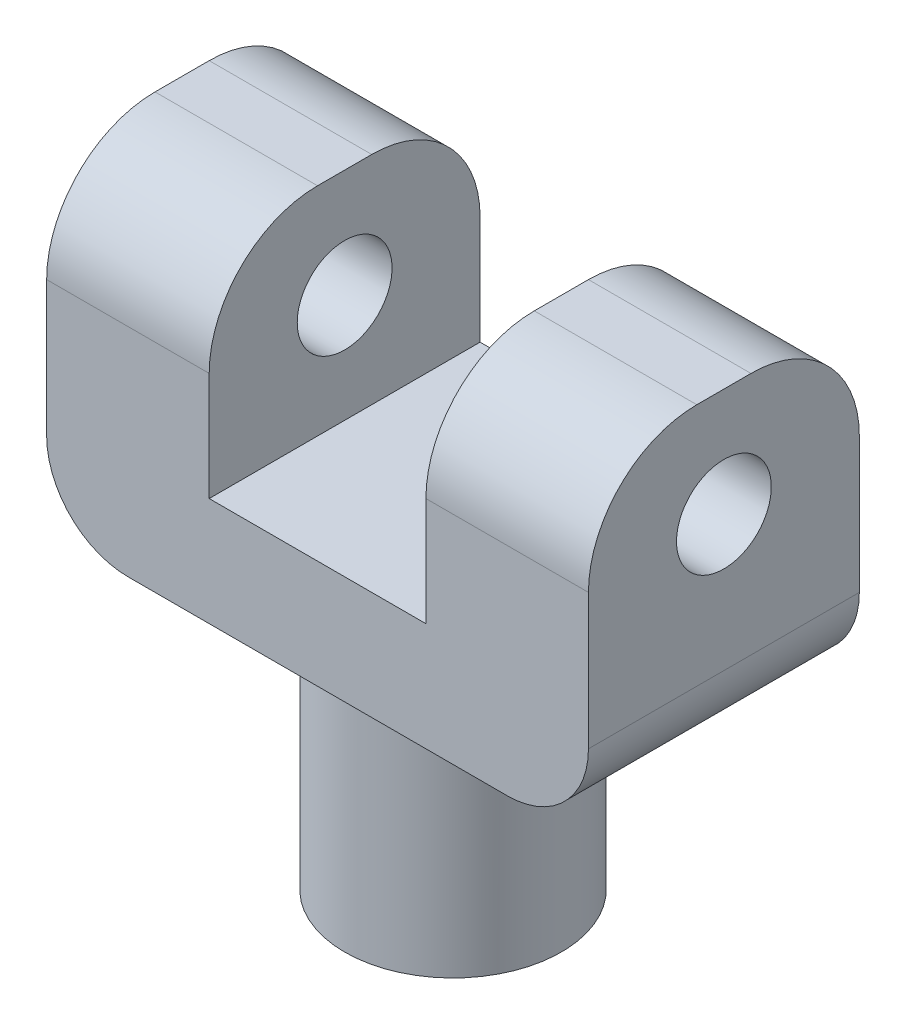
ISO-10303-21;
HEADER;
FILE_DESCRIPTION(('STEP AP214'),'2;1');
FILE_NAME('part.step','',(''),(''),'','','');
FILE_SCHEMA(('AUTOMOTIVE_DESIGN { 1 0 10303 214 1 1 1 1 }'));
ENDSEC;
DATA;
#1=APPLICATION_CONTEXT('core data for automotive mechanical design processes');
#2=APPLICATION_PROTOCOL_DEFINITION('international standard','automotive_design',2000,#1);
#3=PRODUCT_CONTEXT('',#1,'mechanical');
#4=PRODUCT('Part','Part','',(#3));
#5=PRODUCT_RELATED_PRODUCT_CATEGORY('part','',(#4));
#6=PRODUCT_DEFINITION_FORMATION('','',#4);
#7=PRODUCT_DEFINITION_CONTEXT('part definition',#1,'design');
#8=PRODUCT_DEFINITION('design','',#6,#7);
#9=PRODUCT_DEFINITION_SHAPE('','',#8);
#10=(LENGTH_UNIT() NAMED_UNIT(*) SI_UNIT(.MILLI.,.METRE.));
#11=(NAMED_UNIT(*) PLANE_ANGLE_UNIT() SI_UNIT($,.RADIAN.));
#12=(NAMED_UNIT(*) SI_UNIT($,.STERADIAN.) SOLID_ANGLE_UNIT());
#13=UNCERTAINTY_MEASURE_WITH_UNIT(LENGTH_MEASURE(1.E-05),#10,'distance_accuracy_value','');
#14=(GEOMETRIC_REPRESENTATION_CONTEXT(3) GLOBAL_UNCERTAINTY_ASSIGNED_CONTEXT((#13)) GLOBAL_UNIT_ASSIGNED_CONTEXT((#10,
#11,#12)) REPRESENTATION_CONTEXT('',''));
#15=CARTESIAN_POINT('',(0.,0.,0.));
#16=DIRECTION('',(0.,0.,1.));
#17=DIRECTION('',(1.,0.,0.));
#18=AXIS2_PLACEMENT_3D('',#15,#16,#17);
#19=CARTESIAN_POINT('',(0.,12.,0.));
#20=DIRECTION('',(0.,1.,0.));
#21=DIRECTION('',(0.,0.,1.));
#22=AXIS2_PLACEMENT_3D('',#19,#20,#21);
#23=PLANE('',#22);
#24=DIRECTION('',(0.,0.,1.));
#25=VECTOR('',#24,1.);
#26=CARTESIAN_POINT('',(-4.,12.,-5.));
#27=LINE('',#26,#25);
#28=CARTESIAN_POINT('',(-4.,12.,-1.));
#29=VERTEX_POINT('',#28);
#30=CARTESIAN_POINT('',(-4.,12.,0.999999999999999));
#31=VERTEX_POINT('',#30);
#32=EDGE_CURVE('E184',#29,#31,#27,.T.);
#33=ORIENTED_EDGE('',*,*,#32,.F.);
#34=DIRECTION('',(-1.,0.,0.));
#35=VECTOR('',#34,1.);
#36=CARTESIAN_POINT('',(-10.,12.,-1.));
#37=LINE('',#36,#35);
#38=CARTESIAN_POINT('',(-10.,12.,-1.));
#39=VERTEX_POINT('',#38);
#40=EDGE_CURVE('E266',#29,#39,#37,.T.);
#41=ORIENTED_EDGE('',*,*,#40,.T.);
#42=DIRECTION('',(0.,0.,1.));
#43=VECTOR('',#42,1.);
#44=CARTESIAN_POINT('',(-10.,12.,-5.));
#45=LINE('',#44,#43);
#46=CARTESIAN_POINT('',(-10.,12.,0.999999999999999));
#47=VERTEX_POINT('',#46);
#48=EDGE_CURVE('E205',#39,#47,#45,.T.);
#49=ORIENTED_EDGE('',*,*,#48,.T.);
#50=DIRECTION('',(1.,0.,0.));
#51=VECTOR('',#50,1.);
#52=CARTESIAN_POINT('',(-4.,12.,0.999999999999999));
#53=LINE('',#52,#51);
#54=EDGE_CURVE('E262',#47,#31,#53,.T.);
#55=ORIENTED_EDGE('',*,*,#54,.T.);
#56=EDGE_LOOP('',(#33,#41,#49,#55));
#57=FACE_BOUND('',#56,.T.);
#58=ADVANCED_FACE('F42',(#57),#23,.T.);
#59=CARTESIAN_POINT('',(10.,12.,-5.));
#60=DIRECTION('',(-1.,0.,0.));
#61=DIRECTION('',(0.,0.,1.));
#62=AXIS2_PLACEMENT_3D('',#59,#60,#61);
#63=PLANE('',#62);
#64=CARTESIAN_POINT('',(10.,8.,0.));
#65=DIRECTION('',(-1.,0.,0.));
#66=DIRECTION('',(0.,0.,1.));
#67=AXIS2_PLACEMENT_3D('',#64,#65,#66);
#68=CIRCLE('',#67,1.75);
#69=CARTESIAN_POINT('',(10.,8.,1.75));
#70=VERTEX_POINT('',#69);
#71=EDGE_CURVE('E286',#70,#70,#68,.T.);
#72=ORIENTED_EDGE('',*,*,#71,.T.);
#73=EDGE_LOOP('',(#72));
#74=FACE_BOUND('',#73,.T.);
#75=DIRECTION('',(0.,-1.,0.));
#76=VECTOR('',#75,1.);
#77=CARTESIAN_POINT('',(10.,12.,5.));
#78=LINE('',#77,#76);
#79=CARTESIAN_POINT('',(10.,8.,5.));
#80=VERTEX_POINT('',#79);
#81=CARTESIAN_POINT('',(10.,3.,5.));
#82=VERTEX_POINT('',#81);
#83=EDGE_CURVE('E210',#80,#82,#78,.T.);
#84=ORIENTED_EDGE('',*,*,#83,.T.);
#85=DIRECTION('',(0.,0.,-1.));
#86=VECTOR('',#85,1.);
#87=CARTESIAN_POINT('',(10.,3.,-5.));
#88=LINE('',#87,#86);
#89=CARTESIAN_POINT('',(10.,3.,-5.));
#90=VERTEX_POINT('',#89);
#91=EDGE_CURVE('E51',#82,#90,#88,.T.);
#92=ORIENTED_EDGE('',*,*,#91,.T.);
#93=DIRECTION('',(0.,-1.,0.));
#94=VECTOR('',#93,1.);
#95=CARTESIAN_POINT('',(10.,12.,-5.));
#96=LINE('',#95,#94);
#97=CARTESIAN_POINT('',(10.,8.,-5.));
#98=VERTEX_POINT('',#97);
#99=EDGE_CURVE('E226',#98,#90,#96,.T.);
#100=ORIENTED_EDGE('',*,*,#99,.F.);
#101=CARTESIAN_POINT('',(10.,8.,-1.));
#102=DIRECTION('',(-1.,0.,0.));
#103=DIRECTION('',(0.,0.,1.));
#104=AXIS2_PLACEMENT_3D('',#101,#102,#103);
#105=CIRCLE('',#104,4.);
#106=CARTESIAN_POINT('',(10.,12.,-1.));
#107=VERTEX_POINT('',#106);
#108=EDGE_CURVE('E238',#98,#107,#105,.F.);
#109=ORIENTED_EDGE('',*,*,#108,.T.);
#110=DIRECTION('',(0.,0.,-1.));
#111=VECTOR('',#110,1.);
#112=CARTESIAN_POINT('',(10.,12.,-5.));
#113=LINE('',#112,#111);
#114=CARTESIAN_POINT('',(10.,12.,0.999999999999999));
#115=VERTEX_POINT('',#114);
#116=EDGE_CURVE('E201',#115,#107,#113,.T.);
#117=ORIENTED_EDGE('',*,*,#116,.F.);
#118=CARTESIAN_POINT('',(10.,8.,0.999999999999999));
#119=DIRECTION('',(-1.,0.,0.));
#120=DIRECTION('',(0.,0.,1.));
#121=AXIS2_PLACEMENT_3D('',#118,#119,#120);
#122=CIRCLE('',#121,4.);
#123=EDGE_CURVE('E241',#115,#80,#122,.F.);
#124=ORIENTED_EDGE('',*,*,#123,.T.);
#125=EDGE_LOOP('',(#84,#92,#100,#109,#117,#124));
#126=FACE_BOUND('',#125,.T.);
#127=ADVANCED_FACE('F308',(#74,#126),#63,.F.);
#128=CARTESIAN_POINT('',(-10.,12.,-5.));
#129=DIRECTION('',(0.,0.,1.));
#130=DIRECTION('',(1.,0.,0.));
#131=AXIS2_PLACEMENT_3D('',#128,#129,#130);
#132=PLANE('',#131);
#133=DIRECTION('',(-1.,0.,0.));
#134=VECTOR('',#133,1.);
#135=CARTESIAN_POINT('',(-10.,0.,-5.));
#136=LINE('',#135,#134);
#137=CARTESIAN_POINT('',(7.,0.,-5.));
#138=VERTEX_POINT('',#137);
#139=CARTESIAN_POINT('',(-7.,0.,-5.));
#140=VERTEX_POINT('',#139);
#141=EDGE_CURVE('E194',#138,#140,#136,.T.);
#142=ORIENTED_EDGE('',*,*,#141,.T.);
#143=CARTESIAN_POINT('',(-7.,3.,-5.));
#144=DIRECTION('',(0.,0.,1.));
#145=DIRECTION('',(1.,0.,0.));
#146=AXIS2_PLACEMENT_3D('',#143,#144,#145);
#147=CIRCLE('',#146,3.);
#148=CARTESIAN_POINT('',(-10.,3.,-5.));
#149=VERTEX_POINT('',#148);
#150=EDGE_CURVE('E303',#140,#149,#147,.F.);
#151=ORIENTED_EDGE('',*,*,#150,.T.);
#152=DIRECTION('',(0.,-1.,0.));
#153=VECTOR('',#152,1.);
#154=CARTESIAN_POINT('',(-10.,12.,-5.));
#155=LINE('',#154,#153);
#156=CARTESIAN_POINT('',(-10.,8.,-5.));
#157=VERTEX_POINT('',#156);
#158=EDGE_CURVE('E222',#157,#149,#155,.T.);
#159=ORIENTED_EDGE('',*,*,#158,.F.);
#160=DIRECTION('',(-1.,0.,0.));
#161=VECTOR('',#160,1.);
#162=CARTESIAN_POINT('',(-4.,8.,-5.));
#163=LINE('',#162,#161);
#164=CARTESIAN_POINT('',(-4.,8.,-5.));
#165=VERTEX_POINT('',#164);
#166=EDGE_CURVE('E256',#157,#165,#163,.F.);
#167=ORIENTED_EDGE('',*,*,#166,.T.);
#168=DIRECTION('',(0.,1.,0.));
#169=VECTOR('',#168,1.);
#170=CARTESIAN_POINT('',(-4.,4.,-5.));
#171=LINE('',#170,#169);
#172=CARTESIAN_POINT('',(-4.,4.,-5.));
#173=VERTEX_POINT('',#172);
#174=EDGE_CURVE('E191',#173,#165,#171,.T.);
#175=ORIENTED_EDGE('',*,*,#174,.F.);
#176=DIRECTION('',(-1.,0.,0.));
#177=VECTOR('',#176,1.);
#178=CARTESIAN_POINT('',(-4.,4.,-5.));
#179=LINE('',#178,#177);
#180=CARTESIAN_POINT('',(4.,4.,-5.));
#181=VERTEX_POINT('',#180);
#182=EDGE_CURVE('E159',#181,#173,#179,.T.);
#183=ORIENTED_EDGE('',*,*,#182,.F.);
#184=DIRECTION('',(0.,1.,0.));
#185=VECTOR('',#184,1.);
#186=CARTESIAN_POINT('',(4.,4.,-5.));
#187=LINE('',#186,#185);
#188=CARTESIAN_POINT('',(4.,8.,-5.));
#189=VERTEX_POINT('',#188);
#190=EDGE_CURVE('E195',#181,#189,#187,.T.);
#191=ORIENTED_EDGE('',*,*,#190,.T.);
#192=DIRECTION('',(-1.,0.,0.));
#193=VECTOR('',#192,1.);
#194=CARTESIAN_POINT('',(10.,8.,-5.));
#195=LINE('',#194,#193);
#196=EDGE_CURVE('E259',#189,#98,#195,.F.);
#197=ORIENTED_EDGE('',*,*,#196,.T.);
#198=ORIENTED_EDGE('',*,*,#99,.T.);
#199=CARTESIAN_POINT('',(7.,3.,-5.));
#200=DIRECTION('',(0.,0.,1.));
#201=DIRECTION('',(1.,0.,0.));
#202=AXIS2_PLACEMENT_3D('',#199,#200,#201);
#203=CIRCLE('',#202,3.);
#204=EDGE_CURVE('E58',#90,#138,#203,.F.);
#205=ORIENTED_EDGE('',*,*,#204,.T.);
#206=EDGE_LOOP('',(#142,#151,#159,#167,#175,#183,#191,#197,#198,#205));
#207=FACE_BOUND('',#206,.T.);
#208=ADVANCED_FACE('F313',(#207),#132,.F.);
#209=CARTESIAN_POINT('',(-10.,12.,-5.));
#210=DIRECTION('',(1.,0.,0.));
#211=DIRECTION('',(0.,0.,-1.));
#212=AXIS2_PLACEMENT_3D('',#209,#210,#211);
#213=PLANE('',#212);
#214=CARTESIAN_POINT('',(-10.,8.,0.));
#215=DIRECTION('',(-1.,0.,0.));
#216=DIRECTION('',(0.,0.,1.));
#217=AXIS2_PLACEMENT_3D('',#214,#215,#216);
#218=CIRCLE('',#217,1.75);
#219=CARTESIAN_POINT('',(-10.,8.,1.75));
#220=VERTEX_POINT('',#219);
#221=EDGE_CURVE('E404',#220,#220,#218,.T.);
#222=ORIENTED_EDGE('',*,*,#221,.F.);
#223=EDGE_LOOP('',(#222));
#224=FACE_BOUND('',#223,.T.);
#225=ORIENTED_EDGE('',*,*,#158,.T.);
#226=DIRECTION('',(0.,0.,1.));
#227=VECTOR('',#226,1.);
#228=CARTESIAN_POINT('',(-10.,3.,-5.));
#229=LINE('',#228,#227);
#230=CARTESIAN_POINT('',(-10.,3.,5.));
#231=VERTEX_POINT('',#230);
#232=EDGE_CURVE('E281',#149,#231,#229,.T.);
#233=ORIENTED_EDGE('',*,*,#232,.T.);
#234=DIRECTION('',(0.,-1.,0.));
#235=VECTOR('',#234,1.);
#236=CARTESIAN_POINT('',(-10.,12.,5.));
#237=LINE('',#236,#235);
#238=CARTESIAN_POINT('',(-10.,8.,5.));
#239=VERTEX_POINT('',#238);
#240=EDGE_CURVE('E219',#239,#231,#237,.T.);
#241=ORIENTED_EDGE('',*,*,#240,.F.);
#242=CARTESIAN_POINT('',(-10.,8.,0.999999999999999));
#243=DIRECTION('',(1.,0.,0.));
#244=DIRECTION('',(0.,0.,-1.));
#245=AXIS2_PLACEMENT_3D('',#242,#243,#244);
#246=CIRCLE('',#245,4.);
#247=EDGE_CURVE('E270',#239,#47,#246,.F.);
#248=ORIENTED_EDGE('',*,*,#247,.T.);
#249=ORIENTED_EDGE('',*,*,#48,.F.);
#250=CARTESIAN_POINT('',(-10.,8.,-1.));
#251=DIRECTION('',(1.,0.,0.));
#252=DIRECTION('',(0.,0.,-1.));
#253=AXIS2_PLACEMENT_3D('',#250,#251,#252);
#254=CIRCLE('',#253,4.);
#255=EDGE_CURVE('E273',#39,#157,#254,.F.);
#256=ORIENTED_EDGE('',*,*,#255,.T.);
#257=EDGE_LOOP('',(#225,#233,#241,#248,#249,#256));
#258=FACE_BOUND('',#257,.T.);
#259=ADVANCED_FACE('F335',(#224,#258),#213,.F.);
#260=CARTESIAN_POINT('',(-10.,12.,5.));
#261=DIRECTION('',(0.,0.,-1.));
#262=DIRECTION('',(-1.,0.,0.));
#263=AXIS2_PLACEMENT_3D('',#260,#261,#262);
#264=PLANE('',#263);
#265=ORIENTED_EDGE('',*,*,#240,.T.);
#266=CARTESIAN_POINT('',(-7.,3.,5.));
#267=DIRECTION('',(0.,0.,-1.));
#268=DIRECTION('',(-1.,0.,0.));
#269=AXIS2_PLACEMENT_3D('',#266,#267,#268);
#270=CIRCLE('',#269,3.);
#271=CARTESIAN_POINT('',(-7.,0.,5.));
#272=VERTEX_POINT('',#271);
#273=EDGE_CURVE('E293',#231,#272,#270,.F.);
#274=ORIENTED_EDGE('',*,*,#273,.T.);
#275=DIRECTION('',(1.,0.,0.));
#276=VECTOR('',#275,1.);
#277=CARTESIAN_POINT('',(-10.,0.,5.));
#278=LINE('',#277,#276);
#279=CARTESIAN_POINT('',(7.,0.,5.));
#280=VERTEX_POINT('',#279);
#281=EDGE_CURVE('E206',#272,#280,#278,.T.);
#282=ORIENTED_EDGE('',*,*,#281,.T.);
#283=CARTESIAN_POINT('',(7.,3.,5.));
#284=DIRECTION('',(0.,0.,-1.));
#285=DIRECTION('',(-1.,0.,0.));
#286=AXIS2_PLACEMENT_3D('',#283,#284,#285);
#287=CIRCLE('',#286,3.);
#288=EDGE_CURVE('E290',#280,#82,#287,.F.);
#289=ORIENTED_EDGE('',*,*,#288,.T.);
#290=ORIENTED_EDGE('',*,*,#83,.F.);
#291=DIRECTION('',(1.,0.,0.));
#292=VECTOR('',#291,1.);
#293=CARTESIAN_POINT('',(4.,8.,5.));
#294=LINE('',#293,#292);
#295=CARTESIAN_POINT('',(4.,8.,5.));
#296=VERTEX_POINT('',#295);
#297=EDGE_CURVE('E247',#80,#296,#294,.F.);
#298=ORIENTED_EDGE('',*,*,#297,.T.);
#299=DIRECTION('',(0.,1.,0.));
#300=VECTOR('',#299,1.);
#301=CARTESIAN_POINT('',(4.,4.,5.));
#302=LINE('',#301,#300);
#303=CARTESIAN_POINT('',(4.,4.,5.));
#304=VERTEX_POINT('',#303);
#305=EDGE_CURVE('E158',#304,#296,#302,.T.);
#306=ORIENTED_EDGE('',*,*,#305,.F.);
#307=DIRECTION('',(1.,0.,0.));
#308=VECTOR('',#307,1.);
#309=CARTESIAN_POINT('',(-4.,4.,5.));
#310=LINE('',#309,#308);
#311=CARTESIAN_POINT('',(-4.,4.,5.));
#312=VERTEX_POINT('',#311);
#313=EDGE_CURVE('E165',#312,#304,#310,.T.);
#314=ORIENTED_EDGE('',*,*,#313,.F.);
#315=DIRECTION('',(0.,1.,0.));
#316=VECTOR('',#315,1.);
#317=CARTESIAN_POINT('',(-4.,4.,5.));
#318=LINE('',#317,#316);
#319=CARTESIAN_POINT('',(-4.,8.,5.));
#320=VERTEX_POINT('',#319);
#321=EDGE_CURVE('E146',#312,#320,#318,.T.);
#322=ORIENTED_EDGE('',*,*,#321,.T.);
#323=DIRECTION('',(1.,0.,0.));
#324=VECTOR('',#323,1.);
#325=CARTESIAN_POINT('',(-10.,8.,5.));
#326=LINE('',#325,#324);
#327=EDGE_CURVE('E244',#320,#239,#326,.F.);
#328=ORIENTED_EDGE('',*,*,#327,.T.);
#329=EDGE_LOOP('',(#265,#274,#282,#289,#290,#298,#306,#314,#322,#328));
#330=FACE_BOUND('',#329,.T.);
#331=ADVANCED_FACE('F173',(#330),#264,.F.);
#332=DIRECTION('',(0.,0.,-1.));
#333=VECTOR('',#332,1.);
#334=CARTESIAN_POINT('',(4.,12.,-5.));
#335=LINE('',#334,#333);
#336=CARTESIAN_POINT('',(4.,12.,0.999999999999999));
#337=VERTEX_POINT('',#336);
#338=CARTESIAN_POINT('',(4.,12.,-1.));
#339=VERTEX_POINT('',#338);
#340=EDGE_CURVE('E170',#337,#339,#335,.T.);
#341=ORIENTED_EDGE('',*,*,#340,.F.);
#342=DIRECTION('',(1.,0.,0.));
#343=VECTOR('',#342,1.);
#344=CARTESIAN_POINT('',(10.,12.,0.999999999999999));
#345=LINE('',#344,#343);
#346=EDGE_CURVE('E234',#337,#115,#345,.T.);
#347=ORIENTED_EDGE('',*,*,#346,.T.);
#348=ORIENTED_EDGE('',*,*,#116,.T.);
#349=DIRECTION('',(-1.,0.,0.));
#350=VECTOR('',#349,1.);
#351=CARTESIAN_POINT('',(4.,12.,-1.));
#352=LINE('',#351,#350);
#353=EDGE_CURVE('E230',#107,#339,#352,.T.);
#354=ORIENTED_EDGE('',*,*,#353,.T.);
#355=EDGE_LOOP('',(#341,#347,#348,#354));
#356=FACE_BOUND('',#355,.T.);
#357=ADVANCED_FACE('F321',(#356),#23,.T.);
#358=CARTESIAN_POINT('',(0.,0.,0.));
#359=DIRECTION('',(0.,1.,0.));
#360=DIRECTION('',(0.,0.,1.));
#361=AXIS2_PLACEMENT_3D('',#358,#359,#360);
#362=PLANE('',#361);
#363=CARTESIAN_POINT('',(0.,0.,0.));
#364=DIRECTION('',(0.,1.,0.));
#365=DIRECTION('',(0.,0.,1.));
#366=AXIS2_PLACEMENT_3D('',#363,#364,#365);
#367=CIRCLE('',#366,4.);
#368=CARTESIAN_POINT('',(0.,0.,4.));
#369=VERTEX_POINT('',#368);
#370=EDGE_CURVE('E11',#369,#369,#367,.F.);
#371=ORIENTED_EDGE('',*,*,#370,.F.);
#372=EDGE_LOOP('',(#371));
#373=FACE_BOUND('',#372,.T.);
#374=ORIENTED_EDGE('',*,*,#281,.F.);
#375=DIRECTION('',(0.,0.,1.));
#376=VECTOR('',#375,1.);
#377=CARTESIAN_POINT('',(-7.,0.,0.));
#378=LINE('',#377,#376);
#379=EDGE_CURVE('E66',#272,#140,#378,.F.);
#380=ORIENTED_EDGE('',*,*,#379,.T.);
#381=ORIENTED_EDGE('',*,*,#141,.F.);
#382=DIRECTION('',(0.,0.,-1.));
#383=VECTOR('',#382,1.);
#384=CARTESIAN_POINT('',(7.,0.,0.));
#385=LINE('',#384,#383);
#386=EDGE_CURVE('E296',#138,#280,#385,.F.);
#387=ORIENTED_EDGE('',*,*,#386,.T.);
#388=EDGE_LOOP('',(#374,#380,#381,#387));
#389=FACE_BOUND('',#388,.T.);
#390=ADVANCED_FACE('F327',(#373,#389),#362,.F.);
#391=CARTESIAN_POINT('',(-4.,4.,-5.));
#392=DIRECTION('',(-1.,0.,0.));
#393=DIRECTION('',(0.,0.,1.));
#394=AXIS2_PLACEMENT_3D('',#391,#392,#393);
#395=PLANE('',#394);
#396=CARTESIAN_POINT('',(-4.,8.,0.));
#397=DIRECTION('',(-1.,0.,0.));
#398=DIRECTION('',(0.,0.,1.));
#399=AXIS2_PLACEMENT_3D('',#396,#397,#398);
#400=CIRCLE('',#399,1.75);
#401=CARTESIAN_POINT('',(-4.,8.,1.75));
#402=VERTEX_POINT('',#401);
#403=EDGE_CURVE('E187',#402,#402,#400,.T.);
#404=ORIENTED_EDGE('',*,*,#403,.T.);
#405=EDGE_LOOP('',(#404));
#406=FACE_BOUND('',#405,.T.);
#407=ORIENTED_EDGE('',*,*,#174,.T.);
#408=CARTESIAN_POINT('',(-4.,8.,-1.));
#409=DIRECTION('',(-1.,0.,0.));
#410=DIRECTION('',(0.,0.,1.));
#411=AXIS2_PLACEMENT_3D('',#408,#409,#410);
#412=CIRCLE('',#411,4.);
#413=EDGE_CURVE('E278',#165,#29,#412,.F.);
#414=ORIENTED_EDGE('',*,*,#413,.T.);
#415=ORIENTED_EDGE('',*,*,#32,.T.);
#416=CARTESIAN_POINT('',(-4.,8.,0.999999999999999));
#417=DIRECTION('',(-1.,0.,0.));
#418=DIRECTION('',(0.,0.,1.));
#419=AXIS2_PLACEMENT_3D('',#416,#417,#418);
#420=CIRCLE('',#419,4.);
#421=EDGE_CURVE('E153',#31,#320,#420,.F.);
#422=ORIENTED_EDGE('',*,*,#421,.T.);
#423=ORIENTED_EDGE('',*,*,#321,.F.);
#424=DIRECTION('',(0.,0.,1.));
#425=VECTOR('',#424,1.);
#426=CARTESIAN_POINT('',(-4.,4.,-5.));
#427=LINE('',#426,#425);
#428=EDGE_CURVE('E150',#173,#312,#427,.T.);
#429=ORIENTED_EDGE('',*,*,#428,.F.);
#430=EDGE_LOOP('',(#407,#414,#415,#422,#423,#429));
#431=FACE_BOUND('',#430,.T.);
#432=ADVANCED_FACE('F149',(#406,#431),#395,.F.);
#433=CARTESIAN_POINT('',(4.,4.,-5.));
#434=DIRECTION('',(1.,0.,0.));
#435=DIRECTION('',(0.,0.,-1.));
#436=AXIS2_PLACEMENT_3D('',#433,#434,#435);
#437=PLANE('',#436);
#438=CARTESIAN_POINT('',(4.,8.,0.));
#439=DIRECTION('',(1.,0.,0.));
#440=DIRECTION('',(0.,0.,-1.));
#441=AXIS2_PLACEMENT_3D('',#438,#439,#440);
#442=CIRCLE('',#441,1.75);
#443=CARTESIAN_POINT('',(4.,8.,-1.75));
#444=VERTEX_POINT('',#443);
#445=EDGE_CURVE('E282',#444,#444,#442,.T.);
#446=ORIENTED_EDGE('',*,*,#445,.T.);
#447=EDGE_LOOP('',(#446));
#448=FACE_BOUND('',#447,.T.);
#449=ORIENTED_EDGE('',*,*,#305,.T.);
#450=CARTESIAN_POINT('',(4.,8.,0.999999999999999));
#451=DIRECTION('',(1.,0.,0.));
#452=DIRECTION('',(0.,0.,-1.));
#453=AXIS2_PLACEMENT_3D('',#450,#451,#452);
#454=CIRCLE('',#453,4.);
#455=EDGE_CURVE('E253',#296,#337,#454,.F.);
#456=ORIENTED_EDGE('',*,*,#455,.T.);
#457=ORIENTED_EDGE('',*,*,#340,.T.);
#458=CARTESIAN_POINT('',(4.,8.,-1.));
#459=DIRECTION('',(1.,0.,0.));
#460=DIRECTION('',(0.,0.,-1.));
#461=AXIS2_PLACEMENT_3D('',#458,#459,#460);
#462=CIRCLE('',#461,4.);
#463=EDGE_CURVE('E250',#339,#189,#462,.F.);
#464=ORIENTED_EDGE('',*,*,#463,.T.);
#465=ORIENTED_EDGE('',*,*,#190,.F.);
#466=DIRECTION('',(0.,0.,-1.));
#467=VECTOR('',#466,1.);
#468=CARTESIAN_POINT('',(4.,4.,-5.));
#469=LINE('',#468,#467);
#470=EDGE_CURVE('E176',#304,#181,#469,.T.);
#471=ORIENTED_EDGE('',*,*,#470,.F.);
#472=EDGE_LOOP('',(#449,#456,#457,#464,#465,#471));
#473=FACE_BOUND('',#472,.T.);
#474=ADVANCED_FACE('F385',(#448,#473),#437,.F.);
#475=CARTESIAN_POINT('',(0.,4.,0.));
#476=DIRECTION('',(0.,1.,0.));
#477=DIRECTION('',(0.,0.,1.));
#478=AXIS2_PLACEMENT_3D('',#475,#476,#477);
#479=PLANE('',#478);
#480=ORIENTED_EDGE('',*,*,#428,.T.);
#481=ORIENTED_EDGE('',*,*,#313,.T.);
#482=ORIENTED_EDGE('',*,*,#470,.T.);
#483=ORIENTED_EDGE('',*,*,#182,.T.);
#484=EDGE_LOOP('',(#480,#481,#482,#483));
#485=FACE_BOUND('',#484,.T.);
#486=ADVANCED_FACE('F163',(#485),#479,.T.);
#487=CARTESIAN_POINT('',(0.,8.,0.999999999999999));
#488=DIRECTION('',(-1.,0.,0.));
#489=DIRECTION('',(0.,0.,1.));
#490=AXIS2_PLACEMENT_3D('',#487,#488,#489);
#491=CYLINDRICAL_SURFACE('',#490,4.);
#492=ORIENTED_EDGE('',*,*,#455,.F.);
#493=ORIENTED_EDGE('',*,*,#297,.F.);
#494=ORIENTED_EDGE('',*,*,#123,.F.);
#495=ORIENTED_EDGE('',*,*,#346,.F.);
#496=EDGE_LOOP('',(#492,#493,#494,#495));
#497=FACE_BOUND('',#496,.T.);
#498=ADVANCED_FACE('F325',(#497),#491,.T.);
#499=CARTESIAN_POINT('',(0.,8.,-1.));
#500=DIRECTION('',(1.,0.,0.));
#501=DIRECTION('',(0.,0.,-1.));
#502=AXIS2_PLACEMENT_3D('',#499,#500,#501);
#503=CYLINDRICAL_SURFACE('',#502,4.);
#504=ORIENTED_EDGE('',*,*,#108,.F.);
#505=ORIENTED_EDGE('',*,*,#196,.F.);
#506=ORIENTED_EDGE('',*,*,#463,.F.);
#507=ORIENTED_EDGE('',*,*,#353,.F.);
#508=EDGE_LOOP('',(#504,#505,#506,#507));
#509=FACE_BOUND('',#508,.T.);
#510=ADVANCED_FACE('F316',(#509),#503,.T.);
#511=CARTESIAN_POINT('',(0.,8.,-1.));
#512=DIRECTION('',(1.,0.,0.));
#513=DIRECTION('',(0.,0.,-1.));
#514=AXIS2_PLACEMENT_3D('',#511,#512,#513);
#515=CYLINDRICAL_SURFACE('',#514,4.);
#516=ORIENTED_EDGE('',*,*,#413,.F.);
#517=ORIENTED_EDGE('',*,*,#166,.F.);
#518=ORIENTED_EDGE('',*,*,#255,.F.);
#519=ORIENTED_EDGE('',*,*,#40,.F.);
#520=EDGE_LOOP('',(#516,#517,#518,#519));
#521=FACE_BOUND('',#520,.T.);
#522=ADVANCED_FACE('F346',(#521),#515,.T.);
#523=CARTESIAN_POINT('',(0.,8.,0.999999999999999));
#524=DIRECTION('',(-1.,0.,0.));
#525=DIRECTION('',(0.,0.,1.));
#526=AXIS2_PLACEMENT_3D('',#523,#524,#525);
#527=CYLINDRICAL_SURFACE('',#526,4.);
#528=ORIENTED_EDGE('',*,*,#247,.F.);
#529=ORIENTED_EDGE('',*,*,#327,.F.);
#530=ORIENTED_EDGE('',*,*,#421,.F.);
#531=ORIENTED_EDGE('',*,*,#54,.F.);
#532=EDGE_LOOP('',(#528,#529,#530,#531));
#533=FACE_BOUND('',#532,.T.);
#534=ADVANCED_FACE('F338',(#533),#527,.T.);
#535=CARTESIAN_POINT('',(10.,8.,0.));
#536=DIRECTION('',(-1.,0.,0.));
#537=DIRECTION('',(0.,0.,1.));
#538=AXIS2_PLACEMENT_3D('',#535,#536,#537);
#539=CYLINDRICAL_SURFACE('',#538,1.75);
#540=ORIENTED_EDGE('',*,*,#71,.F.);
#541=EDGE_LOOP('',(#540));
#542=FACE_BOUND('',#541,.T.);
#543=ORIENTED_EDGE('',*,*,#445,.F.);
#544=EDGE_LOOP('',(#543));
#545=FACE_BOUND('',#544,.T.);
#546=ADVANCED_FACE('F354',(#542,#545),#539,.F.);
#547=ORIENTED_EDGE('',*,*,#221,.T.);
#548=EDGE_LOOP('',(#547));
#549=FACE_BOUND('',#548,.T.);
#550=ORIENTED_EDGE('',*,*,#403,.F.);
#551=EDGE_LOOP('',(#550));
#552=FACE_BOUND('',#551,.T.);
#553=ADVANCED_FACE('F393',(#549,#552),#539,.F.);
#554=CARTESIAN_POINT('',(-7.,3.,-5.));
#555=DIRECTION('',(0.,0.,1.));
#556=DIRECTION('',(1.,0.,0.));
#557=AXIS2_PLACEMENT_3D('',#554,#555,#556);
#558=CYLINDRICAL_SURFACE('',#557,3.);
#559=ORIENTED_EDGE('',*,*,#150,.F.);
#560=ORIENTED_EDGE('',*,*,#379,.F.);
#561=ORIENTED_EDGE('',*,*,#273,.F.);
#562=ORIENTED_EDGE('',*,*,#232,.F.);
#563=EDGE_LOOP('',(#559,#560,#561,#562));
#564=FACE_BOUND('',#563,.T.);
#565=ADVANCED_FACE('F332',(#564),#558,.T.);
#566=CARTESIAN_POINT('',(7.,3.,-5.));
#567=DIRECTION('',(0.,0.,-1.));
#568=DIRECTION('',(-1.,0.,0.));
#569=AXIS2_PLACEMENT_3D('',#566,#567,#568);
#570=CYLINDRICAL_SURFACE('',#569,3.);
#571=ORIENTED_EDGE('',*,*,#288,.F.);
#572=ORIENTED_EDGE('',*,*,#386,.F.);
#573=ORIENTED_EDGE('',*,*,#204,.F.);
#574=ORIENTED_EDGE('',*,*,#91,.F.);
#575=EDGE_LOOP('',(#571,#572,#573,#574));
#576=FACE_BOUND('',#575,.T.);
#577=ADVANCED_FACE('F44',(#576),#570,.T.);
#578=CARTESIAN_POINT('',(0.,-9.,0.));
#579=DIRECTION('',(0.,1.,0.));
#580=DIRECTION('',(0.,0.,1.));
#581=AXIS2_PLACEMENT_3D('',#578,#579,#580);
#582=CYLINDRICAL_SURFACE('',#581,4.);
#583=CARTESIAN_POINT('',(0.,-9.,0.));
#584=DIRECTION('',(0.,-1.,0.));
#585=DIRECTION('',(0.,0.,-1.));
#586=AXIS2_PLACEMENT_3D('',#583,#584,#585);
#587=CIRCLE('',#586,4.);
#588=CARTESIAN_POINT('',(0.,-9.,-4.));
#589=VERTEX_POINT('',#588);
#590=EDGE_CURVE('E408',#589,#589,#587,.T.);
#591=ORIENTED_EDGE('',*,*,#590,.F.);
#592=EDGE_LOOP('',(#591));
#593=FACE_BOUND('',#592,.T.);
#594=ORIENTED_EDGE('',*,*,#370,.T.);
#595=EDGE_LOOP('',(#594));
#596=FACE_BOUND('',#595,.T.);
#597=ADVANCED_FACE('F435',(#593,#596),#582,.T.);
#598=CARTESIAN_POINT('',(0.,-9.,0.));
#599=DIRECTION('',(0.,-1.,0.));
#600=DIRECTION('',(0.,0.,-1.));
#601=AXIS2_PLACEMENT_3D('',#598,#599,#600);
#602=PLANE('',#601);
#603=CARTESIAN_POINT('',(0.,-9.,0.));
#604=DIRECTION('',(0.,-1.,0.));
#605=DIRECTION('',(0.,0.,-1.));
#606=AXIS2_PLACEMENT_3D('',#603,#604,#605);
#607=CIRCLE('',#606,2.);
#608=CARTESIAN_POINT('',(0.,-9.,-2.));
#609=VERTEX_POINT('',#608);
#610=EDGE_CURVE('E416',#609,#609,#607,.T.);
#611=ORIENTED_EDGE('',*,*,#610,.F.);
#612=EDGE_LOOP('',(#611));
#613=FACE_BOUND('',#612,.T.);
#614=ORIENTED_EDGE('',*,*,#590,.T.);
#615=EDGE_LOOP('',(#614));
#616=FACE_BOUND('',#615,.T.);
#617=ADVANCED_FACE('F429',(#613,#616),#602,.T.);
#618=CARTESIAN_POINT('',(0.,-2.,0.));
#619=DIRECTION('',(0.,-1.,0.));
#620=DIRECTION('',(0.,0.,-1.));
#621=AXIS2_PLACEMENT_3D('',#618,#619,#620);
#622=CYLINDRICAL_SURFACE('',#621,2.);
#623=CARTESIAN_POINT('',(0.,-2.,0.));
#624=DIRECTION('',(0.,-1.,0.));
#625=DIRECTION('',(0.,0.,-1.));
#626=AXIS2_PLACEMENT_3D('',#623,#624,#625);
#627=CIRCLE('',#626,2.);
#628=CARTESIAN_POINT('',(0.,-2.,-2.));
#629=VERTEX_POINT('',#628);
#630=EDGE_CURVE('E415',#629,#629,#627,.T.);
#631=ORIENTED_EDGE('',*,*,#630,.F.);
#632=EDGE_LOOP('',(#631));
#633=FACE_BOUND('',#632,.T.);
#634=ORIENTED_EDGE('',*,*,#610,.T.);
#635=EDGE_LOOP('',(#634));
#636=FACE_BOUND('',#635,.T.);
#637=ADVANCED_FACE('F426',(#633,#636),#622,.F.);
#638=CARTESIAN_POINT('',(0.,-2.,0.));
#639=DIRECTION('',(0.,-1.,0.));
#640=DIRECTION('',(0.,0.,-1.));
#641=AXIS2_PLACEMENT_3D('',#638,#639,#640);
#642=PLANE('',#641);
#643=ORIENTED_EDGE('',*,*,#630,.T.);
#644=EDGE_LOOP('',(#643));
#645=FACE_BOUND('',#644,.T.);
#646=ADVANCED_FACE('F424',(#645),#642,.T.);
#647=CLOSED_SHELL('',(#58,#127,#208,#259,#331,#357,#390,#432,#474,#486,#498,#510,#522,#534,#546,
#553,#565,#577,#597,#617,#637,#646));
#648=MANIFOLD_SOLID_BREP('B2',#647);
#649=ADVANCED_BREP_SHAPE_REPRESENTATION('',(#18,#648),#14);
#650=SHAPE_DEFINITION_REPRESENTATION(#9,#649);
ENDSEC;
END-ISO-10303-21;
